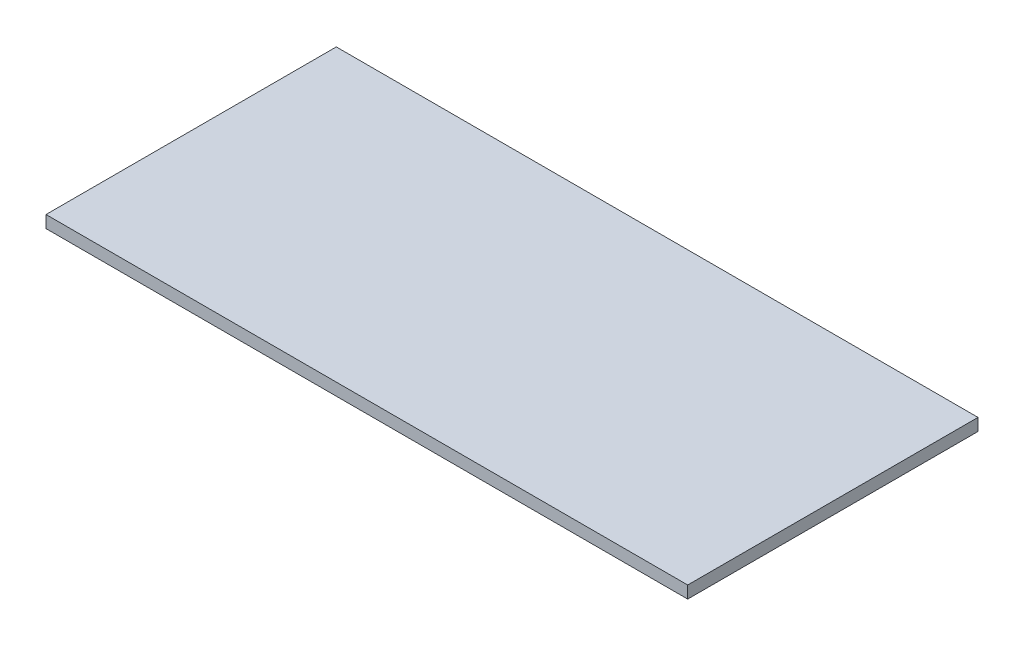
ISO-10303-21;
HEADER;
FILE_DESCRIPTION(('STEP AP214'),'2;1');
FILE_NAME('part.step','',(''),(''),'','','');
FILE_SCHEMA(('AUTOMOTIVE_DESIGN { 1 0 10303 214 1 1 1 1 }'));
ENDSEC;
DATA;
#1=APPLICATION_CONTEXT('core data for automotive mechanical design processes');
#2=APPLICATION_PROTOCOL_DEFINITION('international standard','automotive_design',2000,#1);
#3=PRODUCT_CONTEXT('',#1,'mechanical');
#4=PRODUCT('Part','Part','',(#3));
#5=PRODUCT_RELATED_PRODUCT_CATEGORY('part','',(#4));
#6=PRODUCT_DEFINITION_FORMATION('','',#4);
#7=PRODUCT_DEFINITION_CONTEXT('part definition',#1,'design');
#8=PRODUCT_DEFINITION('design','',#6,#7);
#9=PRODUCT_DEFINITION_SHAPE('','',#8);
#10=(LENGTH_UNIT() NAMED_UNIT(*) SI_UNIT(.MILLI.,.METRE.));
#11=(NAMED_UNIT(*) PLANE_ANGLE_UNIT() SI_UNIT($,.RADIAN.));
#12=(NAMED_UNIT(*) SI_UNIT($,.STERADIAN.) SOLID_ANGLE_UNIT());
#13=UNCERTAINTY_MEASURE_WITH_UNIT(LENGTH_MEASURE(1.E-05),#10,'distance_accuracy_value','');
#14=(GEOMETRIC_REPRESENTATION_CONTEXT(3) GLOBAL_UNCERTAINTY_ASSIGNED_CONTEXT((#13)) GLOBAL_UNIT_ASSIGNED_CONTEXT((#10,
#11,#12)) REPRESENTATION_CONTEXT('',''));
#15=CARTESIAN_POINT('',(0.,0.,0.));
#16=DIRECTION('',(0.,0.,1.));
#17=DIRECTION('',(1.,0.,0.));
#18=AXIS2_PLACEMENT_3D('',#15,#16,#17);
#19=CARTESIAN_POINT('',(105.,4.,47.5));
#20=DIRECTION('',(-1.,0.,0.));
#21=DIRECTION('',(0.,0.,1.));
#22=AXIS2_PLACEMENT_3D('',#19,#20,#21);
#23=PLANE('',#22);
#24=DIRECTION('',(0.,0.,-1.));
#25=VECTOR('',#24,1.);
#26=CARTESIAN_POINT('',(105.,0.,47.5));
#27=LINE('',#26,#25);
#28=CARTESIAN_POINT('',(105.,0.,47.5));
#29=VERTEX_POINT('',#28);
#30=CARTESIAN_POINT('',(105.,0.,-47.5));
#31=VERTEX_POINT('',#30);
#32=EDGE_CURVE('E96',#29,#31,#27,.T.);
#33=ORIENTED_EDGE('',*,*,#32,.T.);
#34=DIRECTION('',(0.,-1.,0.));
#35=VECTOR('',#34,1.);
#36=CARTESIAN_POINT('',(105.,4.,-47.5));
#37=LINE('',#36,#35);
#38=CARTESIAN_POINT('',(105.,4.,-47.5));
#39=VERTEX_POINT('',#38);
#40=EDGE_CURVE('E11',#39,#31,#37,.T.);
#41=ORIENTED_EDGE('',*,*,#40,.F.);
#42=DIRECTION('',(0.,0.,-1.));
#43=VECTOR('',#42,1.);
#44=CARTESIAN_POINT('',(105.,4.,47.5));
#45=LINE('',#44,#43);
#46=CARTESIAN_POINT('',(105.,4.,47.5));
#47=VERTEX_POINT('',#46);
#48=EDGE_CURVE('E84',#47,#39,#45,.T.);
#49=ORIENTED_EDGE('',*,*,#48,.F.);
#50=DIRECTION('',(0.,-1.,0.));
#51=VECTOR('',#50,1.);
#52=CARTESIAN_POINT('',(105.,4.,47.5));
#53=LINE('',#52,#51);
#54=EDGE_CURVE('E92',#47,#29,#53,.T.);
#55=ORIENTED_EDGE('',*,*,#54,.T.);
#56=EDGE_LOOP('',(#33,#41,#49,#55));
#57=FACE_BOUND('',#56,.T.);
#58=ADVANCED_FACE('F33',(#57),#23,.F.);
#59=CARTESIAN_POINT('',(-105.,4.,-47.5));
#60=DIRECTION('',(0.,0.,1.));
#61=DIRECTION('',(1.,0.,0.));
#62=AXIS2_PLACEMENT_3D('',#59,#60,#61);
#63=PLANE('',#62);
#64=DIRECTION('',(-1.,0.,0.));
#65=VECTOR('',#64,1.);
#66=CARTESIAN_POINT('',(-105.,0.,-47.5));
#67=LINE('',#66,#65);
#68=CARTESIAN_POINT('',(-105.,0.,-47.5));
#69=VERTEX_POINT('',#68);
#70=EDGE_CURVE('E88',#31,#69,#67,.T.);
#71=ORIENTED_EDGE('',*,*,#70,.T.);
#72=DIRECTION('',(0.,-1.,0.));
#73=VECTOR('',#72,1.);
#74=CARTESIAN_POINT('',(-105.,4.,-47.5));
#75=LINE('',#74,#73);
#76=CARTESIAN_POINT('',(-105.,4.,-47.5));
#77=VERTEX_POINT('',#76);
#78=EDGE_CURVE('E41',#77,#69,#75,.T.);
#79=ORIENTED_EDGE('',*,*,#78,.F.);
#80=DIRECTION('',(-1.,0.,0.));
#81=VECTOR('',#80,1.);
#82=CARTESIAN_POINT('',(-105.,4.,-47.5));
#83=LINE('',#82,#81);
#84=EDGE_CURVE('E79',#39,#77,#83,.T.);
#85=ORIENTED_EDGE('',*,*,#84,.F.);
#86=ORIENTED_EDGE('',*,*,#40,.T.);
#87=EDGE_LOOP('',(#71,#79,#85,#86));
#88=FACE_BOUND('',#87,.T.);
#89=ADVANCED_FACE('F87',(#88),#63,.F.);
#90=CARTESIAN_POINT('',(-105.,4.,47.5));
#91=DIRECTION('',(1.,0.,0.));
#92=DIRECTION('',(0.,0.,-1.));
#93=AXIS2_PLACEMENT_3D('',#90,#91,#92);
#94=PLANE('',#93);
#95=DIRECTION('',(0.,0.,1.));
#96=VECTOR('',#95,1.);
#97=CARTESIAN_POINT('',(-105.,0.,47.5));
#98=LINE('',#97,#96);
#99=CARTESIAN_POINT('',(-105.,0.,47.5));
#100=VERTEX_POINT('',#99);
#101=EDGE_CURVE('E66',#69,#100,#98,.T.);
#102=ORIENTED_EDGE('',*,*,#101,.T.);
#103=DIRECTION('',(0.,-1.,0.));
#104=VECTOR('',#103,1.);
#105=CARTESIAN_POINT('',(-105.,4.,47.5));
#106=LINE('',#105,#104);
#107=CARTESIAN_POINT('',(-105.,4.,47.5));
#108=VERTEX_POINT('',#107);
#109=EDGE_CURVE('E89',#108,#100,#106,.T.);
#110=ORIENTED_EDGE('',*,*,#109,.F.);
#111=DIRECTION('',(0.,0.,1.));
#112=VECTOR('',#111,1.);
#113=CARTESIAN_POINT('',(-105.,4.,47.5));
#114=LINE('',#113,#112);
#115=EDGE_CURVE('E82',#77,#108,#114,.T.);
#116=ORIENTED_EDGE('',*,*,#115,.F.);
#117=ORIENTED_EDGE('',*,*,#78,.T.);
#118=EDGE_LOOP('',(#102,#110,#116,#117));
#119=FACE_BOUND('',#118,.T.);
#120=ADVANCED_FACE('F90',(#119),#94,.F.);
#121=CARTESIAN_POINT('',(-105.,4.,47.5));
#122=DIRECTION('',(0.,0.,-1.));
#123=DIRECTION('',(-1.,0.,0.));
#124=AXIS2_PLACEMENT_3D('',#121,#122,#123);
#125=PLANE('',#124);
#126=DIRECTION('',(1.,0.,0.));
#127=VECTOR('',#126,1.);
#128=CARTESIAN_POINT('',(-105.,0.,47.5));
#129=LINE('',#128,#127);
#130=EDGE_CURVE('E72',#100,#29,#129,.T.);
#131=ORIENTED_EDGE('',*,*,#130,.T.);
#132=ORIENTED_EDGE('',*,*,#54,.F.);
#133=DIRECTION('',(1.,0.,0.));
#134=VECTOR('',#133,1.);
#135=CARTESIAN_POINT('',(-105.,4.,47.5));
#136=LINE('',#135,#134);
#137=EDGE_CURVE('E49',#108,#47,#136,.T.);
#138=ORIENTED_EDGE('',*,*,#137,.F.);
#139=ORIENTED_EDGE('',*,*,#109,.T.);
#140=EDGE_LOOP('',(#131,#132,#138,#139));
#141=FACE_BOUND('',#140,.T.);
#142=ADVANCED_FACE('F103',(#141),#125,.F.);
#143=CARTESIAN_POINT('',(0.,4.,0.));
#144=DIRECTION('',(0.,-1.,0.));
#145=DIRECTION('',(0.,0.,-1.));
#146=AXIS2_PLACEMENT_3D('',#143,#144,#145);
#147=PLANE('',#146);
#148=ORIENTED_EDGE('',*,*,#48,.T.);
#149=ORIENTED_EDGE('',*,*,#84,.T.);
#150=ORIENTED_EDGE('',*,*,#115,.T.);
#151=ORIENTED_EDGE('',*,*,#137,.T.);
#152=EDGE_LOOP('',(#148,#149,#150,#151));
#153=FACE_BOUND('',#152,.T.);
#154=ADVANCED_FACE('F80',(#153),#147,.F.);
#155=CARTESIAN_POINT('',(0.,0.,0.));
#156=DIRECTION('',(0.,-1.,0.));
#157=DIRECTION('',(0.,0.,-1.));
#158=AXIS2_PLACEMENT_3D('',#155,#156,#157);
#159=PLANE('',#158);
#160=ORIENTED_EDGE('',*,*,#32,.F.);
#161=ORIENTED_EDGE('',*,*,#130,.F.);
#162=ORIENTED_EDGE('',*,*,#101,.F.);
#163=ORIENTED_EDGE('',*,*,#70,.F.);
#164=EDGE_LOOP('',(#160,#161,#162,#163));
#165=FACE_BOUND('',#164,.T.);
#166=ADVANCED_FACE('F106',(#165),#159,.T.);
#167=CLOSED_SHELL('',(#58,#89,#120,#142,#154,#166));
#168=MANIFOLD_SOLID_BREP('B2',#167);
#169=ADVANCED_BREP_SHAPE_REPRESENTATION('',(#18,#168),#14);
#170=SHAPE_DEFINITION_REPRESENTATION(#9,#169);
ENDSEC;
END-ISO-10303-21;
